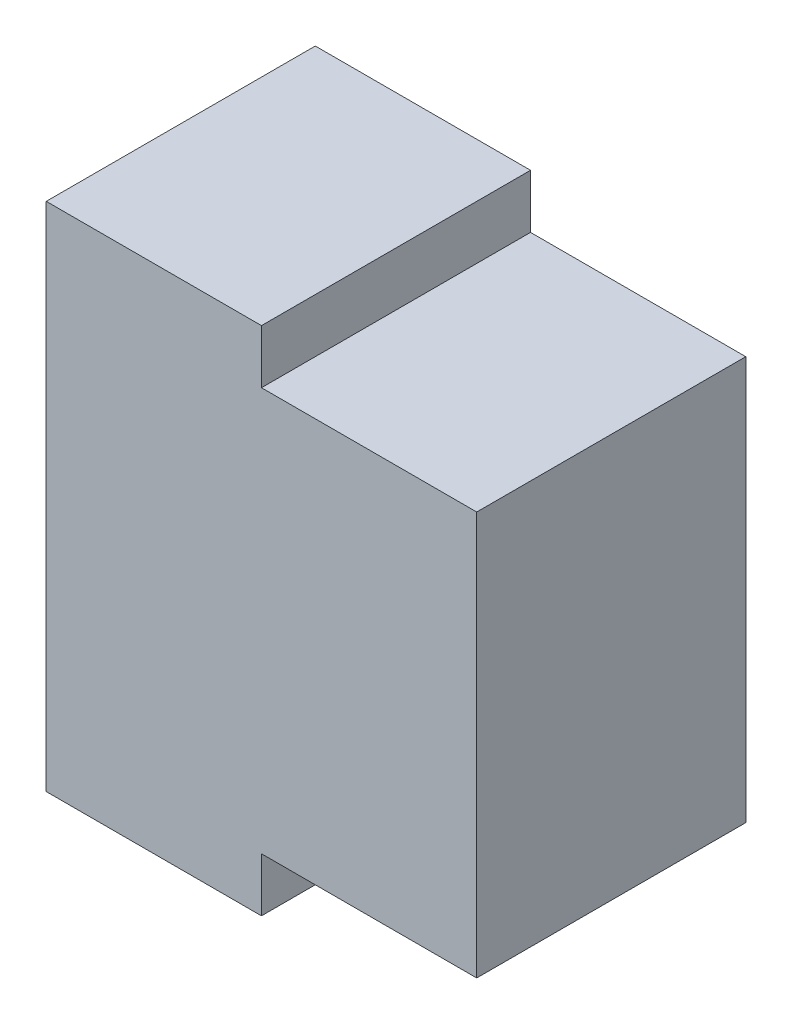
ISO-10303-21;
HEADER;
FILE_DESCRIPTION(('STEP AP214'),'2;1');
FILE_NAME('part.step','',(''),(''),'','','');
FILE_SCHEMA(('AUTOMOTIVE_DESIGN { 1 0 10303 214 1 1 1 1 }'));
ENDSEC;
DATA;
#1=APPLICATION_CONTEXT('core data for automotive mechanical design processes');
#2=APPLICATION_PROTOCOL_DEFINITION('international standard','automotive_design',2000,#1);
#3=PRODUCT_CONTEXT('',#1,'mechanical');
#4=PRODUCT('Part','Part','',(#3));
#5=PRODUCT_RELATED_PRODUCT_CATEGORY('part','',(#4));
#6=PRODUCT_DEFINITION_FORMATION('','',#4);
#7=PRODUCT_DEFINITION_CONTEXT('part definition',#1,'design');
#8=PRODUCT_DEFINITION('design','',#6,#7);
#9=PRODUCT_DEFINITION_SHAPE('','',#8);
#10=(LENGTH_UNIT() NAMED_UNIT(*) SI_UNIT(.MILLI.,.METRE.));
#11=(NAMED_UNIT(*) PLANE_ANGLE_UNIT() SI_UNIT($,.RADIAN.));
#12=(NAMED_UNIT(*) SI_UNIT($,.STERADIAN.) SOLID_ANGLE_UNIT());
#13=UNCERTAINTY_MEASURE_WITH_UNIT(LENGTH_MEASURE(1.E-05),#10,'distance_accuracy_value','');
#14=(GEOMETRIC_REPRESENTATION_CONTEXT(3) GLOBAL_UNCERTAINTY_ASSIGNED_CONTEXT((#13)) GLOBAL_UNIT_ASSIGNED_CONTEXT((#10,
#11,#12)) REPRESENTATION_CONTEXT('',''));
#15=CARTESIAN_POINT('',(0.,0.,0.));
#16=DIRECTION('',(0.,0.,1.));
#17=DIRECTION('',(1.,0.,0.));
#18=AXIS2_PLACEMENT_3D('',#15,#16,#17);
#19=CARTESIAN_POINT('',(-2.66142857142855,0.,0.925));
#20=DIRECTION('',(0.,0.,1.));
#21=DIRECTION('',(1.,0.,0.));
#22=AXIS2_PLACEMENT_3D('',#19,#20,#21);
#23=PLANE('',#22);
#24=DIRECTION('',(0.,-1.,0.));
#25=VECTOR('',#24,1.);
#26=CARTESIAN_POINT('',(-3.03,0.475000000000082,0.925));
#27=LINE('',#26,#25);
#28=CARTESIAN_POINT('',(-3.03,0.475000000000082,0.925));
#29=VERTEX_POINT('',#28);
#30=CARTESIAN_POINT('',(-3.03,-0.475000000000021,0.925));
#31=VERTEX_POINT('',#30);
#32=EDGE_CURVE('E26',#29,#31,#27,.T.);
#33=ORIENTED_EDGE('',*,*,#32,.F.);
#34=DIRECTION('',(-1.,0.,0.));
#35=VECTOR('',#34,1.);
#36=CARTESIAN_POINT('',(-2.78,0.475000000000081,0.925));
#37=LINE('',#36,#35);
#38=CARTESIAN_POINT('',(-2.63,0.475000000000081,0.925));
#39=VERTEX_POINT('',#38);
#40=EDGE_CURVE('E454',#39,#29,#37,.T.);
#41=ORIENTED_EDGE('',*,*,#40,.F.);
#42=DIRECTION('',(0.,1.,0.));
#43=VECTOR('',#42,1.);
#44=CARTESIAN_POINT('',(-2.63,0.375,0.925));
#45=LINE('',#44,#43);
#46=CARTESIAN_POINT('',(-2.63,0.375,0.925));
#47=VERTEX_POINT('',#46);
#48=EDGE_CURVE('E413',#47,#39,#45,.T.);
#49=ORIENTED_EDGE('',*,*,#48,.F.);
#50=DIRECTION('',(-1.,0.,0.));
#51=VECTOR('',#50,1.);
#52=CARTESIAN_POINT('',(-2.22999999999996,0.375,0.925));
#53=LINE('',#52,#51);
#54=CARTESIAN_POINT('',(-2.22999999999996,0.375,0.925));
#55=VERTEX_POINT('',#54);
#56=EDGE_CURVE('E398',#55,#47,#53,.T.);
#57=ORIENTED_EDGE('',*,*,#56,.F.);
#58=DIRECTION('',(0.,1.,0.));
#59=VECTOR('',#58,1.);
#60=CARTESIAN_POINT('',(-2.22999999999996,-0.375,0.925));
#61=LINE('',#60,#59);
#62=CARTESIAN_POINT('',(-2.22999999999996,-0.375,0.925));
#63=VERTEX_POINT('',#62);
#64=EDGE_CURVE('E123',#63,#55,#61,.T.);
#65=ORIENTED_EDGE('',*,*,#64,.F.);
#66=DIRECTION('',(1.,0.,0.));
#67=VECTOR('',#66,1.);
#68=CARTESIAN_POINT('',(-2.78,-0.375,0.925));
#69=LINE('',#68,#67);
#70=CARTESIAN_POINT('',(-2.63,-0.375,0.925));
#71=VERTEX_POINT('',#70);
#72=EDGE_CURVE('E116',#71,#63,#69,.T.);
#73=ORIENTED_EDGE('',*,*,#72,.F.);
#74=DIRECTION('',(0.,1.,0.));
#75=VECTOR('',#74,1.);
#76=CARTESIAN_POINT('',(-2.63,0.375,0.925));
#77=LINE('',#76,#75);
#78=CARTESIAN_POINT('',(-2.63,-0.475000000000021,0.925));
#79=VERTEX_POINT('',#78);
#80=EDGE_CURVE('E99',#79,#71,#77,.T.);
#81=ORIENTED_EDGE('',*,*,#80,.F.);
#82=DIRECTION('',(1.,0.,0.));
#83=VECTOR('',#82,1.);
#84=CARTESIAN_POINT('',(-3.03,-0.475000000000021,0.925));
#85=LINE('',#84,#83);
#86=EDGE_CURVE('E140',#31,#79,#85,.T.);
#87=ORIENTED_EDGE('',*,*,#86,.F.);
#88=EDGE_LOOP('',(#33,#41,#49,#57,#65,#73,#81,#87));
#89=FACE_BOUND('',#88,.T.);
#90=ADVANCED_FACE('F17',(#89),#23,.F.);
#91=CARTESIAN_POINT('',(-2.66142857142855,0.,1.425));
#92=DIRECTION('',(0.,0.,1.));
#93=DIRECTION('',(1.,0.,0.));
#94=AXIS2_PLACEMENT_3D('',#91,#92,#93);
#95=PLANE('',#94);
#96=DIRECTION('',(0.,-1.,0.));
#97=VECTOR('',#96,1.);
#98=CARTESIAN_POINT('',(-3.03,0.475000000000082,1.425));
#99=LINE('',#98,#97);
#100=CARTESIAN_POINT('',(-3.03,0.475000000000082,1.425));
#101=VERTEX_POINT('',#100);
#102=CARTESIAN_POINT('',(-3.03,-0.475000000000021,1.425));
#103=VERTEX_POINT('',#102);
#104=EDGE_CURVE('E11',#101,#103,#99,.T.);
#105=ORIENTED_EDGE('',*,*,#104,.T.);
#106=DIRECTION('',(1.,0.,0.));
#107=VECTOR('',#106,1.);
#108=CARTESIAN_POINT('',(-3.03,-0.475000000000021,1.425));
#109=LINE('',#108,#107);
#110=CARTESIAN_POINT('',(-2.63,-0.475000000000021,1.425));
#111=VERTEX_POINT('',#110);
#112=EDGE_CURVE('E146',#103,#111,#109,.T.);
#113=ORIENTED_EDGE('',*,*,#112,.T.);
#114=DIRECTION('',(0.,1.,0.));
#115=VECTOR('',#114,1.);
#116=CARTESIAN_POINT('',(-2.63,0.,1.425));
#117=LINE('',#116,#115);
#118=CARTESIAN_POINT('',(-2.63,-0.375,1.425));
#119=VERTEX_POINT('',#118);
#120=EDGE_CURVE('E111',#111,#119,#117,.T.);
#121=ORIENTED_EDGE('',*,*,#120,.T.);
#122=DIRECTION('',(1.,0.,0.));
#123=VECTOR('',#122,1.);
#124=CARTESIAN_POINT('',(-2.78,-0.375,1.425));
#125=LINE('',#124,#123);
#126=CARTESIAN_POINT('',(-2.22999999999996,-0.375,1.425));
#127=VERTEX_POINT('',#126);
#128=EDGE_CURVE('E118',#119,#127,#125,.T.);
#129=ORIENTED_EDGE('',*,*,#128,.T.);
#130=DIRECTION('',(0.,1.,0.));
#131=VECTOR('',#130,1.);
#132=CARTESIAN_POINT('',(-2.22999999999996,-0.375,1.425));
#133=LINE('',#132,#131);
#134=CARTESIAN_POINT('',(-2.22999999999996,0.375,1.425));
#135=VERTEX_POINT('',#134);
#136=EDGE_CURVE('E133',#127,#135,#133,.T.);
#137=ORIENTED_EDGE('',*,*,#136,.T.);
#138=DIRECTION('',(-1.,0.,0.));
#139=VECTOR('',#138,1.);
#140=CARTESIAN_POINT('',(-2.22999999999996,0.375,1.425));
#141=LINE('',#140,#139);
#142=CARTESIAN_POINT('',(-2.63,0.375,1.425));
#143=VERTEX_POINT('',#142);
#144=EDGE_CURVE('E394',#135,#143,#141,.T.);
#145=ORIENTED_EDGE('',*,*,#144,.T.);
#146=DIRECTION('',(0.,1.,0.));
#147=VECTOR('',#146,1.);
#148=CARTESIAN_POINT('',(-2.63,0.375,1.425));
#149=LINE('',#148,#147);
#150=CARTESIAN_POINT('',(-2.63,0.475000000000081,1.425));
#151=VERTEX_POINT('',#150);
#152=EDGE_CURVE('E409',#143,#151,#149,.T.);
#153=ORIENTED_EDGE('',*,*,#152,.T.);
#154=DIRECTION('',(-1.,0.,0.));
#155=VECTOR('',#154,1.);
#156=CARTESIAN_POINT('',(-2.78,0.475000000000081,1.425));
#157=LINE('',#156,#155);
#158=EDGE_CURVE('E435',#151,#101,#157,.T.);
#159=ORIENTED_EDGE('',*,*,#158,.T.);
#160=EDGE_LOOP('',(#105,#113,#121,#129,#137,#145,#153,#159));
#161=FACE_BOUND('',#160,.T.);
#162=ADVANCED_FACE('F158',(#161),#95,.T.);
#163=CARTESIAN_POINT('',(-3.03,0.475000000000082,0.925));
#164=DIRECTION('',(-1.,0.,0.));
#165=DIRECTION('',(0.,1.,0.));
#166=AXIS2_PLACEMENT_3D('',#163,#164,#165);
#167=PLANE('',#166);
#168=ORIENTED_EDGE('',*,*,#32,.T.);
#169=DIRECTION('',(0.,0.,1.));
#170=VECTOR('',#169,1.);
#171=CARTESIAN_POINT('',(-3.03,-0.475000000000021,0.925));
#172=LINE('',#171,#170);
#173=EDGE_CURVE('E143',#31,#103,#172,.T.);
#174=ORIENTED_EDGE('',*,*,#173,.T.);
#175=ORIENTED_EDGE('',*,*,#104,.F.);
#176=DIRECTION('',(0.,0.,1.));
#177=VECTOR('',#176,1.);
#178=CARTESIAN_POINT('',(-3.03,0.475000000000082,0.925));
#179=LINE('',#178,#177);
#180=EDGE_CURVE('E439',#29,#101,#179,.T.);
#181=ORIENTED_EDGE('',*,*,#180,.F.);
#182=EDGE_LOOP('',(#168,#174,#175,#181));
#183=FACE_BOUND('',#182,.T.);
#184=ADVANCED_FACE('F154',(#183),#167,.T.);
#185=CARTESIAN_POINT('',(-3.03,-0.475000000000021,0.925));
#186=DIRECTION('',(0.,-1.,0.));
#187=DIRECTION('',(-1.,0.,0.));
#188=AXIS2_PLACEMENT_3D('',#185,#186,#187);
#189=PLANE('',#188);
#190=ORIENTED_EDGE('',*,*,#86,.T.);
#191=DIRECTION('',(0.,0.,1.));
#192=VECTOR('',#191,1.);
#193=CARTESIAN_POINT('',(-2.63,-0.475000000000021,0.925));
#194=LINE('',#193,#192);
#195=EDGE_CURVE('E106',#79,#111,#194,.T.);
#196=ORIENTED_EDGE('',*,*,#195,.T.);
#197=ORIENTED_EDGE('',*,*,#112,.F.);
#198=ORIENTED_EDGE('',*,*,#173,.F.);
#199=EDGE_LOOP('',(#190,#196,#197,#198));
#200=FACE_BOUND('',#199,.T.);
#201=ADVANCED_FACE('F157',(#200),#189,.T.);
#202=CARTESIAN_POINT('',(-2.63,0.375,0.925));
#203=DIRECTION('',(1.,0.,0.));
#204=DIRECTION('',(0.,-1.,0.));
#205=AXIS2_PLACEMENT_3D('',#202,#203,#204);
#206=PLANE('',#205);
#207=ORIENTED_EDGE('',*,*,#80,.T.);
#208=DIRECTION('',(0.,0.,1.));
#209=VECTOR('',#208,1.);
#210=CARTESIAN_POINT('',(-2.63,-0.375,0.925));
#211=LINE('',#210,#209);
#212=EDGE_CURVE('E103',#71,#119,#211,.T.);
#213=ORIENTED_EDGE('',*,*,#212,.T.);
#214=ORIENTED_EDGE('',*,*,#120,.F.);
#215=ORIENTED_EDGE('',*,*,#195,.F.);
#216=EDGE_LOOP('',(#207,#213,#214,#215));
#217=FACE_BOUND('',#216,.T.);
#218=ADVANCED_FACE('F101',(#217),#206,.T.);
#219=CARTESIAN_POINT('',(-2.78,-0.375,0.925));
#220=DIRECTION('',(0.,-1.,0.));
#221=DIRECTION('',(-1.,0.,0.));
#222=AXIS2_PLACEMENT_3D('',#219,#220,#221);
#223=PLANE('',#222);
#224=ORIENTED_EDGE('',*,*,#72,.T.);
#225=DIRECTION('',(0.,0.,1.));
#226=VECTOR('',#225,1.);
#227=CARTESIAN_POINT('',(-2.22999999999996,-0.375,0.925));
#228=LINE('',#227,#226);
#229=EDGE_CURVE('E125',#63,#127,#228,.T.);
#230=ORIENTED_EDGE('',*,*,#229,.T.);
#231=ORIENTED_EDGE('',*,*,#128,.F.);
#232=ORIENTED_EDGE('',*,*,#212,.F.);
#233=EDGE_LOOP('',(#224,#230,#231,#232));
#234=FACE_BOUND('',#233,.T.);
#235=ADVANCED_FACE('F114',(#234),#223,.T.);
#236=CARTESIAN_POINT('',(-2.22999999999996,-0.375,0.925));
#237=DIRECTION('',(1.,0.,0.));
#238=DIRECTION('',(0.,1.,0.));
#239=AXIS2_PLACEMENT_3D('',#236,#237,#238);
#240=PLANE('',#239);
#241=ORIENTED_EDGE('',*,*,#64,.T.);
#242=DIRECTION('',(0.,0.,1.));
#243=VECTOR('',#242,1.);
#244=CARTESIAN_POINT('',(-2.22999999999996,0.375,0.925));
#245=LINE('',#244,#243);
#246=EDGE_CURVE('E384',#55,#135,#245,.T.);
#247=ORIENTED_EDGE('',*,*,#246,.T.);
#248=ORIENTED_EDGE('',*,*,#136,.F.);
#249=ORIENTED_EDGE('',*,*,#229,.F.);
#250=EDGE_LOOP('',(#241,#247,#248,#249));
#251=FACE_BOUND('',#250,.T.);
#252=ADVANCED_FACE('F278',(#251),#240,.T.);
#253=CARTESIAN_POINT('',(-2.22999999999996,0.375,0.925));
#254=DIRECTION('',(0.,1.,0.));
#255=DIRECTION('',(1.,0.,0.));
#256=AXIS2_PLACEMENT_3D('',#253,#254,#255);
#257=PLANE('',#256);
#258=ORIENTED_EDGE('',*,*,#56,.T.);
#259=DIRECTION('',(0.,0.,1.));
#260=VECTOR('',#259,1.);
#261=CARTESIAN_POINT('',(-2.63,0.375,0.925));
#262=LINE('',#261,#260);
#263=EDGE_CURVE('E405',#47,#143,#262,.T.);
#264=ORIENTED_EDGE('',*,*,#263,.T.);
#265=ORIENTED_EDGE('',*,*,#144,.F.);
#266=ORIENTED_EDGE('',*,*,#246,.F.);
#267=EDGE_LOOP('',(#258,#264,#265,#266));
#268=FACE_BOUND('',#267,.T.);
#269=ADVANCED_FACE('F293',(#268),#257,.T.);
#270=CARTESIAN_POINT('',(-2.63,0.375,0.925));
#271=DIRECTION('',(1.,0.,0.));
#272=DIRECTION('',(0.,-1.,0.));
#273=AXIS2_PLACEMENT_3D('',#270,#271,#272);
#274=PLANE('',#273);
#275=ORIENTED_EDGE('',*,*,#48,.T.);
#276=DIRECTION('',(0.,0.,1.));
#277=VECTOR('',#276,1.);
#278=CARTESIAN_POINT('',(-2.63,0.475000000000081,0.925));
#279=LINE('',#278,#277);
#280=EDGE_CURVE('E431',#39,#151,#279,.T.);
#281=ORIENTED_EDGE('',*,*,#280,.T.);
#282=ORIENTED_EDGE('',*,*,#152,.F.);
#283=ORIENTED_EDGE('',*,*,#263,.F.);
#284=EDGE_LOOP('',(#275,#281,#282,#283));
#285=FACE_BOUND('',#284,.T.);
#286=ADVANCED_FACE('F306',(#285),#274,.T.);
#287=CARTESIAN_POINT('',(-2.78,0.475000000000081,0.925));
#288=DIRECTION('',(0.,1.,0.));
#289=DIRECTION('',(1.,0.,0.));
#290=AXIS2_PLACEMENT_3D('',#287,#288,#289);
#291=PLANE('',#290);
#292=ORIENTED_EDGE('',*,*,#40,.T.);
#293=ORIENTED_EDGE('',*,*,#180,.T.);
#294=ORIENTED_EDGE('',*,*,#158,.F.);
#295=ORIENTED_EDGE('',*,*,#280,.F.);
#296=EDGE_LOOP('',(#292,#293,#294,#295));
#297=FACE_BOUND('',#296,.T.);
#298=ADVANCED_FACE('F310',(#297),#291,.T.);
#299=CLOSED_SHELL('',(#90,#162,#184,#201,#218,#235,#252,#269,#286,#298));
#300=MANIFOLD_SOLID_BREP('B1',#299);
#301=ADVANCED_BREP_SHAPE_REPRESENTATION('',(#18,#300),#14);
#302=SHAPE_DEFINITION_REPRESENTATION(#9,#301);
ENDSEC;
END-ISO-10303-21;
